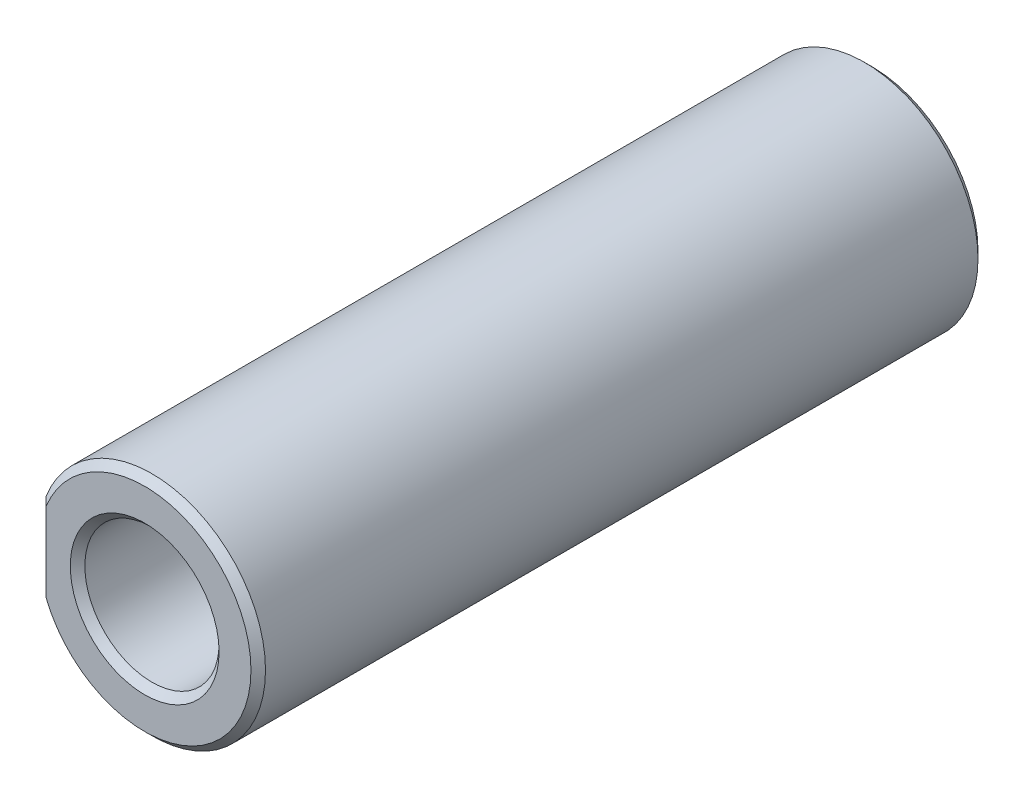
ISO-10303-21;
HEADER;
FILE_DESCRIPTION(('STEP AP214'),'2;1');
FILE_NAME('part.step','',(''),(''),'','','');
FILE_SCHEMA(('AUTOMOTIVE_DESIGN { 1 0 10303 214 1 1 1 1 }'));
ENDSEC;
DATA;
#1=APPLICATION_CONTEXT('core data for automotive mechanical design processes');
#2=APPLICATION_PROTOCOL_DEFINITION('international standard','automotive_design',2000,#1);
#3=PRODUCT_CONTEXT('',#1,'mechanical');
#4=PRODUCT('Part','Part','',(#3));
#5=PRODUCT_RELATED_PRODUCT_CATEGORY('part','',(#4));
#6=PRODUCT_DEFINITION_FORMATION('','',#4);
#7=PRODUCT_DEFINITION_CONTEXT('part definition',#1,'design');
#8=PRODUCT_DEFINITION('design','',#6,#7);
#9=PRODUCT_DEFINITION_SHAPE('','',#8);
#10=(LENGTH_UNIT() NAMED_UNIT(*) SI_UNIT(.MILLI.,.METRE.));
#11=(NAMED_UNIT(*) PLANE_ANGLE_UNIT() SI_UNIT($,.RADIAN.));
#12=(NAMED_UNIT(*) SI_UNIT($,.STERADIAN.) SOLID_ANGLE_UNIT());
#13=UNCERTAINTY_MEASURE_WITH_UNIT(LENGTH_MEASURE(1.E-05),#10,'distance_accuracy_value','');
#14=(GEOMETRIC_REPRESENTATION_CONTEXT(3) GLOBAL_UNCERTAINTY_ASSIGNED_CONTEXT((#13)) GLOBAL_UNIT_ASSIGNED_CONTEXT((#10,
#11,#12)) REPRESENTATION_CONTEXT('',''));
#15=CARTESIAN_POINT('',(0.,0.,0.));
#16=DIRECTION('',(0.,0.,1.));
#17=DIRECTION('',(1.,0.,0.));
#18=AXIS2_PLACEMENT_3D('',#15,#16,#17);
#19=CARTESIAN_POINT('',(0.,0.,38.1));
#20=DIRECTION('',(0.,0.,-1.));
#21=DIRECTION('',(-1.,0.,0.));
#22=AXIS2_PLACEMENT_3D('',#19,#20,#21);
#23=CYLINDRICAL_SURFACE('',#22,5.95);
#24=DIRECTION('',(0.,0.,-1.));
#25=VECTOR('',#24,1.);
#26=CARTESIAN_POINT('',(-5.553125,2.1366569060977,38.1));
#27=LINE('',#26,#25);
#28=CARTESIAN_POINT('',(-5.553125,2.1366569060977,0.381000000000027));
#29=VERTEX_POINT('',#28);
#30=CARTESIAN_POINT('',(-5.553125,2.1366569060977,37.719));
#31=VERTEX_POINT('',#30);
#32=EDGE_CURVE('E93',#29,#31,#27,.F.);
#33=ORIENTED_EDGE('',*,*,#32,.T.);
#34=CARTESIAN_POINT('',(0.,0.,37.719));
#35=DIRECTION('',(0.,0.,1.));
#36=DIRECTION('',(1.,0.,0.));
#37=AXIS2_PLACEMENT_3D('',#34,#35,#36);
#38=CIRCLE('',#37,5.95);
#39=CARTESIAN_POINT('',(-5.553125,-2.1366569060977,37.719));
#40=VERTEX_POINT('',#39);
#41=EDGE_CURVE('E114',#31,#40,#38,.F.);
#42=ORIENTED_EDGE('',*,*,#41,.T.);
#43=DIRECTION('',(0.,0.,-1.));
#44=VECTOR('',#43,1.);
#45=CARTESIAN_POINT('',(-5.553125,-2.1366569060977,38.1));
#46=LINE('',#45,#44);
#47=CARTESIAN_POINT('',(-5.553125,-2.1366569060977,0.381000000000027));
#48=VERTEX_POINT('',#47);
#49=EDGE_CURVE('E230',#40,#48,#46,.T.);
#50=ORIENTED_EDGE('',*,*,#49,.T.);
#51=CARTESIAN_POINT('',(0.,0.,0.381000000000013));
#52=DIRECTION('',(0.,0.,1.));
#53=DIRECTION('',(1.,0.,0.));
#54=AXIS2_PLACEMENT_3D('',#51,#52,#53);
#55=CIRCLE('',#54,5.95);
#56=EDGE_CURVE('E112',#48,#29,#55,.T.);
#57=ORIENTED_EDGE('',*,*,#56,.T.);
#58=EDGE_LOOP('',(#33,#42,#50,#57));
#59=FACE_BOUND('',#58,.T.);
#60=ADVANCED_FACE('F39',(#59),#23,.T.);
#61=CARTESIAN_POINT('',(0.,0.,38.1));
#62=DIRECTION('',(0.,0.,1.));
#63=DIRECTION('',(1.,0.,0.));
#64=AXIS2_PLACEMENT_3D('',#61,#62,#63);
#65=PLANE('',#64);
#66=CARTESIAN_POINT('',(0.,0.,38.1));
#67=DIRECTION('',(0.,0.,1.));
#68=DIRECTION('',(1.,0.,0.));
#69=AXIS2_PLACEMENT_3D('',#66,#67,#68);
#70=CIRCLE('',#69,3.89890000000001);
#71=CARTESIAN_POINT('',(3.89890000000001,0.,38.1));
#72=VERTEX_POINT('',#71);
#73=EDGE_CURVE('E102',#72,#72,#70,.F.);
#74=ORIENTED_EDGE('',*,*,#73,.T.);
#75=EDGE_LOOP('',(#74));
#76=FACE_BOUND('',#75,.T.);
#77=CARTESIAN_POINT('',(0.,0.,38.1));
#78=DIRECTION('',(0.,0.,1.));
#79=DIRECTION('',(1.,0.,0.));
#80=AXIS2_PLACEMENT_3D('',#77,#78,#79);
#81=CIRCLE('',#80,5.56900000000003);
#82=CARTESIAN_POINT('',(-5.17212500000003,-2.06467527334811,38.1));
#83=VERTEX_POINT('',#82);
#84=CARTESIAN_POINT('',(-5.17212500000003,2.06467527334811,38.1));
#85=VERTEX_POINT('',#84);
#86=EDGE_CURVE('E96',#83,#85,#81,.T.);
#87=ORIENTED_EDGE('',*,*,#86,.T.);
#88=DIRECTION('',(0.,-1.,0.));
#89=VECTOR('',#88,1.);
#90=CARTESIAN_POINT('',(-5.17212500000003,-2.1366569060977,38.1));
#91=LINE('',#90,#89);
#92=EDGE_CURVE('E87',#85,#83,#91,.T.);
#93=ORIENTED_EDGE('',*,*,#92,.T.);
#94=EDGE_LOOP('',(#87,#93));
#95=FACE_BOUND('',#94,.T.);
#96=ADVANCED_FACE('F101',(#76,#95),#65,.T.);
#97=CARTESIAN_POINT('',(0.,0.,0.));
#98=DIRECTION('',(0.,0.,1.));
#99=DIRECTION('',(1.,0.,0.));
#100=AXIS2_PLACEMENT_3D('',#97,#98,#99);
#101=PLANE('',#100);
#102=CARTESIAN_POINT('',(0.,0.,0.));
#103=DIRECTION('',(0.,0.,1.));
#104=DIRECTION('',(1.,0.,0.));
#105=AXIS2_PLACEMENT_3D('',#102,#103,#104);
#106=CIRCLE('',#105,3.571875);
#107=CARTESIAN_POINT('',(3.571875,0.,0.));
#108=VERTEX_POINT('',#107);
#109=EDGE_CURVE('E11',#108,#108,#106,.T.);
#110=ORIENTED_EDGE('',*,*,#109,.T.);
#111=EDGE_LOOP('',(#110));
#112=FACE_BOUND('',#111,.T.);
#113=CARTESIAN_POINT('',(0.,0.,0.));
#114=DIRECTION('',(0.,0.,1.));
#115=DIRECTION('',(1.,0.,0.));
#116=AXIS2_PLACEMENT_3D('',#113,#114,#115);
#117=CIRCLE('',#116,5.56899999999999);
#118=CARTESIAN_POINT('',(-5.17212499999998,2.0646752733481,0.));
#119=VERTEX_POINT('',#118);
#120=CARTESIAN_POINT('',(-5.17212499999998,-2.0646752733481,0.));
#121=VERTEX_POINT('',#120);
#122=EDGE_CURVE('E53',#119,#121,#117,.F.);
#123=ORIENTED_EDGE('',*,*,#122,.T.);
#124=DIRECTION('',(0.,1.,0.));
#125=VECTOR('',#124,1.);
#126=CARTESIAN_POINT('',(-5.17212499999999,0.,0.));
#127=LINE('',#126,#125);
#128=EDGE_CURVE('E120',#121,#119,#127,.T.);
#129=ORIENTED_EDGE('',*,*,#128,.T.);
#130=EDGE_LOOP('',(#123,#129));
#131=FACE_BOUND('',#130,.T.);
#132=ADVANCED_FACE('F190',(#112,#131),#101,.F.);
#133=CARTESIAN_POINT('',(0.,0.,-1.5875));
#134=DIRECTION('',(0.,0.,1.));
#135=DIRECTION('',(1.,0.,0.));
#136=AXIS2_PLACEMENT_3D('',#133,#134,#135);
#137=CYLINDRICAL_SURFACE('',#136,3.175);
#138=CARTESIAN_POINT('',(0.,0.,-0.396875));
#139=DIRECTION('',(0.,0.,1.));
#140=DIRECTION('',(1.,0.,0.));
#141=AXIS2_PLACEMENT_3D('',#138,#139,#140);
#142=CIRCLE('',#141,3.175);
#143=CARTESIAN_POINT('',(3.175,0.,-0.396875));
#144=VERTEX_POINT('',#143);
#145=EDGE_CURVE('E47',#144,#144,#142,.F.);
#146=ORIENTED_EDGE('',*,*,#145,.T.);
#147=EDGE_LOOP('',(#146));
#148=FACE_BOUND('',#147,.T.);
#149=CARTESIAN_POINT('',(0.,0.,-1.2065));
#150=DIRECTION('',(0.,0.,-1.));
#151=DIRECTION('',(-1.,0.,0.));
#152=AXIS2_PLACEMENT_3D('',#149,#150,#151);
#153=CIRCLE('',#152,3.175);
#154=CARTESIAN_POINT('',(-3.175,0.,-1.2065));
#155=VERTEX_POINT('',#154);
#156=EDGE_CURVE('E116',#155,#155,#153,.F.);
#157=ORIENTED_EDGE('',*,*,#156,.T.);
#158=EDGE_LOOP('',(#157));
#159=FACE_BOUND('',#158,.T.);
#160=ADVANCED_FACE('F175',(#148,#159),#137,.T.);
#161=CARTESIAN_POINT('',(0.,0.,-1.5875));
#162=DIRECTION('',(0.,0.,-1.));
#163=DIRECTION('',(-1.,0.,0.));
#164=AXIS2_PLACEMENT_3D('',#161,#162,#163);
#165=PLANE('',#164);
#166=CARTESIAN_POINT('',(0.,0.,-1.5875));
#167=DIRECTION('',(0.,0.,-1.));
#168=DIRECTION('',(-1.,0.,0.));
#169=AXIS2_PLACEMENT_3D('',#166,#167,#168);
#170=CIRCLE('',#169,2.10819999999998);
#171=CARTESIAN_POINT('',(-2.10819999999998,0.,-1.5875));
#172=VERTEX_POINT('',#171);
#173=EDGE_CURVE('E216',#172,#172,#170,.F.);
#174=ORIENTED_EDGE('',*,*,#173,.T.);
#175=EDGE_LOOP('',(#174));
#176=FACE_BOUND('',#175,.T.);
#177=CARTESIAN_POINT('',(0.,0.,-1.5875));
#178=DIRECTION('',(0.,0.,-1.));
#179=DIRECTION('',(-1.,0.,0.));
#180=AXIS2_PLACEMENT_3D('',#177,#178,#179);
#181=CIRCLE('',#180,2.794);
#182=CARTESIAN_POINT('',(-2.794,0.,-1.5875));
#183=VERTEX_POINT('',#182);
#184=EDGE_CURVE('E218',#183,#183,#181,.T.);
#185=ORIENTED_EDGE('',*,*,#184,.T.);
#186=EDGE_LOOP('',(#185));
#187=FACE_BOUND('',#186,.T.);
#188=ADVANCED_FACE('F244',(#176,#187),#165,.T.);
#189=CARTESIAN_POINT('',(0.,0.,9.525));
#190=DIRECTION('',(0.,0.,1.));
#191=DIRECTION('',(1.,0.,0.));
#192=AXIS2_PLACEMENT_3D('',#189,#190,#191);
#193=CONICAL_SURFACE('',#192,3.51789999999999,1.02974425867665);
#194=CARTESIAN_POINT('',(0.,0.,8.44903888950734));
#195=DIRECTION('',(0.,0.,1.));
#196=DIRECTION('',(1.,0.,0.));
#197=AXIS2_PLACEMENT_3D('',#194,#195,#196);
#198=CIRCLE('',#197,1.72719999999999);
#199=CARTESIAN_POINT('',(1.72719999999999,0.,8.44903888950734));
#200=VERTEX_POINT('',#199);
#201=EDGE_CURVE('E227',#200,#200,#198,.F.);
#202=ORIENTED_EDGE('',*,*,#201,.T.);
#203=EDGE_LOOP('',(#202));
#204=FACE_BOUND('',#203,.T.);
#205=CARTESIAN_POINT('',(0.,0.,9.525));
#206=DIRECTION('',(0.,0.,1.));
#207=DIRECTION('',(1.,0.,0.));
#208=AXIS2_PLACEMENT_3D('',#205,#206,#207);
#209=CIRCLE('',#208,3.51789999999999);
#210=CARTESIAN_POINT('',(3.51789999999999,0.,9.525));
#211=VERTEX_POINT('',#210);
#212=EDGE_CURVE('E226',#211,#211,#209,.T.);
#213=ORIENTED_EDGE('',*,*,#212,.T.);
#214=EDGE_LOOP('',(#213));
#215=FACE_BOUND('',#214,.T.);
#216=ADVANCED_FACE('F249',(#204,#215),#193,.F.);
#217=CARTESIAN_POINT('',(0.,0.,38.1));
#218=DIRECTION('',(0.,0.,1.));
#219=DIRECTION('',(1.,0.,0.));
#220=AXIS2_PLACEMENT_3D('',#217,#218,#219);
#221=CYLINDRICAL_SURFACE('',#220,3.5179);
#222=CARTESIAN_POINT('',(0.,0.,37.719));
#223=DIRECTION('',(0.,0.,1.));
#224=DIRECTION('',(1.,0.,0.));
#225=AXIS2_PLACEMENT_3D('',#222,#223,#224);
#226=CIRCLE('',#225,3.5179);
#227=CARTESIAN_POINT('',(3.5179,0.,37.719));
#228=VERTEX_POINT('',#227);
#229=EDGE_CURVE('E99',#228,#228,#226,.T.);
#230=ORIENTED_EDGE('',*,*,#229,.T.);
#231=EDGE_LOOP('',(#230));
#232=FACE_BOUND('',#231,.T.);
#233=ORIENTED_EDGE('',*,*,#212,.F.);
#234=EDGE_LOOP('',(#233));
#235=FACE_BOUND('',#234,.T.);
#236=ADVANCED_FACE('F255',(#232,#235),#221,.F.);
#237=CARTESIAN_POINT('',(0.,0.,-1.5875));
#238=DIRECTION('',(0.,0.,-1.));
#239=DIRECTION('',(-1.,0.,0.));
#240=AXIS2_PLACEMENT_3D('',#237,#238,#239);
#241=CYLINDRICAL_SURFACE('',#240,1.72719999999999);
#242=CARTESIAN_POINT('',(0.,0.,-1.20650000000001));
#243=DIRECTION('',(0.,0.,-1.));
#244=DIRECTION('',(-1.,0.,0.));
#245=AXIS2_PLACEMENT_3D('',#242,#243,#244);
#246=CIRCLE('',#245,1.72719999999999);
#247=CARTESIAN_POINT('',(-1.72719999999999,0.,-1.20650000000001));
#248=VERTEX_POINT('',#247);
#249=EDGE_CURVE('E223',#248,#248,#246,.T.);
#250=ORIENTED_EDGE('',*,*,#249,.T.);
#251=EDGE_LOOP('',(#250));
#252=FACE_BOUND('',#251,.T.);
#253=ORIENTED_EDGE('',*,*,#201,.F.);
#254=EDGE_LOOP('',(#253));
#255=FACE_BOUND('',#254,.T.);
#256=ADVANCED_FACE('F259',(#252,#255),#241,.F.);
#257=CARTESIAN_POINT('',(-5.553125,0.,0.));
#258=DIRECTION('',(1.,0.,0.));
#259=DIRECTION('',(0.,0.,-1.));
#260=AXIS2_PLACEMENT_3D('',#257,#258,#259);
#261=PLANE('',#260);
#262=ORIENTED_EDGE('',*,*,#49,.F.);
#263=DIRECTION('',(0.,1.,0.));
#264=VECTOR('',#263,1.);
#265=CARTESIAN_POINT('',(-5.553125,2.1366569060977,37.719));
#266=LINE('',#265,#264);
#267=EDGE_CURVE('E90',#40,#31,#266,.T.);
#268=ORIENTED_EDGE('',*,*,#267,.T.);
#269=ORIENTED_EDGE('',*,*,#32,.F.);
#270=DIRECTION('',(0.,-1.,0.));
#271=VECTOR('',#270,1.);
#272=CARTESIAN_POINT('',(-5.553125,0.,0.381000000000012));
#273=LINE('',#272,#271);
#274=EDGE_CURVE('E105',#29,#48,#273,.T.);
#275=ORIENTED_EDGE('',*,*,#274,.T.);
#276=EDGE_LOOP('',(#262,#268,#269,#275));
#277=FACE_BOUND('',#276,.T.);
#278=ADVANCED_FACE('F202',(#277),#261,.F.);
#279=CARTESIAN_POINT('',(0.,0.,-1.20650000000001));
#280=DIRECTION('',(0.,0.,-1.));
#281=DIRECTION('',(-1.,0.,0.));
#282=AXIS2_PLACEMENT_3D('',#279,#280,#281);
#283=CONICAL_SURFACE('',#282,1.72719999999999,0.78539816339745);
#284=ORIENTED_EDGE('',*,*,#173,.F.);
#285=EDGE_LOOP('',(#284));
#286=FACE_BOUND('',#285,.T.);
#287=ORIENTED_EDGE('',*,*,#249,.F.);
#288=EDGE_LOOP('',(#287));
#289=FACE_BOUND('',#288,.T.);
#290=ADVANCED_FACE('F197',(#286,#289),#283,.F.);
#291=CARTESIAN_POINT('',(0.,0.,37.719));
#292=DIRECTION('',(0.,0.,1.));
#293=DIRECTION('',(1.,0.,0.));
#294=AXIS2_PLACEMENT_3D('',#291,#292,#293);
#295=CONICAL_SURFACE('',#294,3.5179,0.785398163397437);
#296=ORIENTED_EDGE('',*,*,#73,.F.);
#297=EDGE_LOOP('',(#296));
#298=FACE_BOUND('',#297,.T.);
#299=ORIENTED_EDGE('',*,*,#229,.F.);
#300=EDGE_LOOP('',(#299));
#301=FACE_BOUND('',#300,.T.);
#302=ADVANCED_FACE('F201',(#298,#301),#295,.F.);
#303=CARTESIAN_POINT('',(0.,0.,38.1));
#304=DIRECTION('',(0.,0.,-1.));
#305=DIRECTION('',(-1.,0.,0.));
#306=AXIS2_PLACEMENT_3D('',#303,#304,#305);
#307=CONICAL_SURFACE('',#306,5.56900000000003,0.785398163397436);
#308=CARTESIAN_POINT('',(-5.553125,2.1366569060977,37.719));
#309=CARTESIAN_POINT('',(-5.48960592791672,2.12486189363377,37.7825190720833));
#310=CARTESIAN_POINT('',(-5.42609639320224,2.11296591826104,37.8460286067978));
#311=CARTESIAN_POINT('',(-5.29909639320065,2.08897204069473,37.9730286067994));
#312=CARTESIAN_POINT('',(-5.23560592791515,2.07687413848427,38.0365190720849));
#313=CARTESIAN_POINT('',(-5.17212500000003,2.06467527334811,38.1));
#314=B_SPLINE_CURVE_WITH_KNOTS('',3,(#308,#309,#310,#311,#312,#313),.UNSPECIFIED.,.F.,.F.,(4,2,
4),(0.,0.271801262072725,0.543602546874887),.UNSPECIFIED.);
#315=EDGE_CURVE('E94',#85,#31,#314,.F.);
#316=ORIENTED_EDGE('',*,*,#315,.F.);
#317=ORIENTED_EDGE('',*,*,#86,.F.);
#318=CARTESIAN_POINT('',(-5.17212500000003,-2.06467527334811,38.1));
#319=CARTESIAN_POINT('',(-5.23560592791515,-2.07687413848426,38.0365190720849));
#320=CARTESIAN_POINT('',(-5.29909639320065,-2.08897204069473,37.9730286067994));
#321=CARTESIAN_POINT('',(-5.42609639320224,-2.11296591826104,37.8460286067978));
#322=CARTESIAN_POINT('',(-5.48960592791672,-2.12486189363378,37.7825190720833));
#323=CARTESIAN_POINT('',(-5.553125,-2.13665690609772,37.719));
#324=B_SPLINE_CURVE_WITH_KNOTS('',3,(#318,#319,#320,#321,#322,#323),.UNSPECIFIED.,.F.,.F.,(4,2,
4),(0.,0.271801284802161,0.543602546874887),.UNSPECIFIED.);
#325=EDGE_CURVE('E83',#40,#83,#324,.F.);
#326=ORIENTED_EDGE('',*,*,#325,.F.);
#327=ORIENTED_EDGE('',*,*,#41,.F.);
#328=EDGE_LOOP('',(#316,#317,#326,#327));
#329=FACE_BOUND('',#328,.T.);
#330=ADVANCED_FACE('F97',(#329),#307,.T.);
#331=CARTESIAN_POINT('',(-5.553125,0.,37.719));
#332=DIRECTION('',(-0.707106781186556,0.,0.707106781186539));
#333=DIRECTION('',(0.,-1.,0.));
#334=AXIS2_PLACEMENT_3D('',#331,#332,#333);
#335=PLANE('',#334);
#336=ORIENTED_EDGE('',*,*,#325,.T.);
#337=ORIENTED_EDGE('',*,*,#92,.F.);
#338=ORIENTED_EDGE('',*,*,#315,.T.);
#339=ORIENTED_EDGE('',*,*,#267,.F.);
#340=EDGE_LOOP('',(#336,#337,#338,#339));
#341=FACE_BOUND('',#340,.T.);
#342=ADVANCED_FACE('F85',(#341),#335,.T.);
#343=CARTESIAN_POINT('',(0.,0.,-1.5875));
#344=DIRECTION('',(0.,0.,1.));
#345=DIRECTION('',(1.,0.,0.));
#346=AXIS2_PLACEMENT_3D('',#343,#344,#345);
#347=CONICAL_SURFACE('',#346,2.794,0.785398163397448);
#348=ORIENTED_EDGE('',*,*,#156,.F.);
#349=EDGE_LOOP('',(#348));
#350=FACE_BOUND('',#349,.T.);
#351=ORIENTED_EDGE('',*,*,#184,.F.);
#352=EDGE_LOOP('',(#351));
#353=FACE_BOUND('',#352,.T.);
#354=ADVANCED_FACE('F144',(#350,#353),#347,.T.);
#355=CARTESIAN_POINT('',(0.,0.,0.381000000000013));
#356=DIRECTION('',(0.,0.,1.));
#357=DIRECTION('',(1.,0.,0.));
#358=AXIS2_PLACEMENT_3D('',#355,#356,#357);
#359=CONICAL_SURFACE('',#358,5.95,0.78539816339745);
#360=CARTESIAN_POINT('',(-5.17212499999999,2.0646752733481,0.));
#361=CARTESIAN_POINT('',(-5.23560592791511,2.07687413848425,0.0634809279151249));
#362=CARTESIAN_POINT('',(-5.29909639320062,2.08897204069472,0.126971393200637));
#363=CARTESIAN_POINT('',(-5.42609639320222,2.11296591826104,0.253971393202236));
#364=CARTESIAN_POINT('',(-5.48960592791672,2.12486189363378,0.317480927916727));
#365=CARTESIAN_POINT('',(-5.553125,2.13665690609772,0.381000000000011));
#366=B_SPLINE_CURVE_WITH_KNOTS('',3,(#360,#361,#362,#363,#364,#365),.UNSPECIFIED.,.F.,.F.,(4,2,
4),(0.,0.271801284802191,0.543602546874943),.UNSPECIFIED.);
#367=EDGE_CURVE('E61',#29,#119,#366,.F.);
#368=ORIENTED_EDGE('',*,*,#367,.F.);
#369=ORIENTED_EDGE('',*,*,#56,.F.);
#370=CARTESIAN_POINT('',(-5.553125,-2.1366569060977,0.381000000000013));
#371=CARTESIAN_POINT('',(-5.48960592791672,-2.12486189363377,0.317480927916728));
#372=CARTESIAN_POINT('',(-5.42609639320222,-2.11296591826103,0.253971393202236));
#373=CARTESIAN_POINT('',(-5.29909639320062,-2.08897204069472,0.126971393200637));
#374=CARTESIAN_POINT('',(-5.23560592791511,-2.07687413848426,0.0634809279151242));
#375=CARTESIAN_POINT('',(-5.17212499999999,-2.06467527334811,0.));
#376=B_SPLINE_CURVE_WITH_KNOTS('',3,(#370,#371,#372,#373,#374,#375),.UNSPECIFIED.,.F.,.F.,(4,2,
4),(0.,0.271801262072752,0.543602546874943),.UNSPECIFIED.);
#377=EDGE_CURVE('E128',#121,#48,#376,.F.);
#378=ORIENTED_EDGE('',*,*,#377,.F.);
#379=ORIENTED_EDGE('',*,*,#122,.F.);
#380=EDGE_LOOP('',(#368,#369,#378,#379));
#381=FACE_BOUND('',#380,.T.);
#382=ADVANCED_FACE('F152',(#381),#359,.T.);
#383=CARTESIAN_POINT('',(-5.17212499999999,0.,0.));
#384=DIRECTION('',(0.707106781186546,0.,0.707106781186549));
#385=DIRECTION('',(0.,1.,0.));
#386=AXIS2_PLACEMENT_3D('',#383,#384,#385);
#387=PLANE('',#386);
#388=ORIENTED_EDGE('',*,*,#377,.T.);
#389=ORIENTED_EDGE('',*,*,#274,.F.);
#390=ORIENTED_EDGE('',*,*,#367,.T.);
#391=ORIENTED_EDGE('',*,*,#128,.F.);
#392=EDGE_LOOP('',(#388,#389,#390,#391));
#393=FACE_BOUND('',#392,.T.);
#394=ADVANCED_FACE('F159',(#393),#387,.F.);
#395=CARTESIAN_POINT('',(0.,0.,-0.396875));
#396=DIRECTION('',(0.,0.,1.));
#397=DIRECTION('',(1.,0.,0.));
#398=AXIS2_PLACEMENT_3D('',#395,#396,#397);
#399=TOROIDAL_SURFACE('',#398,3.571875,0.396875);
#400=ORIENTED_EDGE('',*,*,#109,.F.);
#401=EDGE_LOOP('',(#400));
#402=FACE_BOUND('',#401,.T.);
#403=ORIENTED_EDGE('',*,*,#145,.F.);
#404=EDGE_LOOP('',(#403));
#405=FACE_BOUND('',#404,.T.);
#406=ADVANCED_FACE('F41',(#402,#405),#399,.F.);
#407=CLOSED_SHELL('',(#60,#96,#132,#160,#188,#216,#236,#256,#278,#290,#302,#330,#342,#354,#382,
#394,#406));
#408=MANIFOLD_SOLID_BREP('B2',#407);
#409=ADVANCED_BREP_SHAPE_REPRESENTATION('',(#18,#408),#14);
#410=SHAPE_DEFINITION_REPRESENTATION(#9,#409);
ENDSEC;
END-ISO-10303-21;
